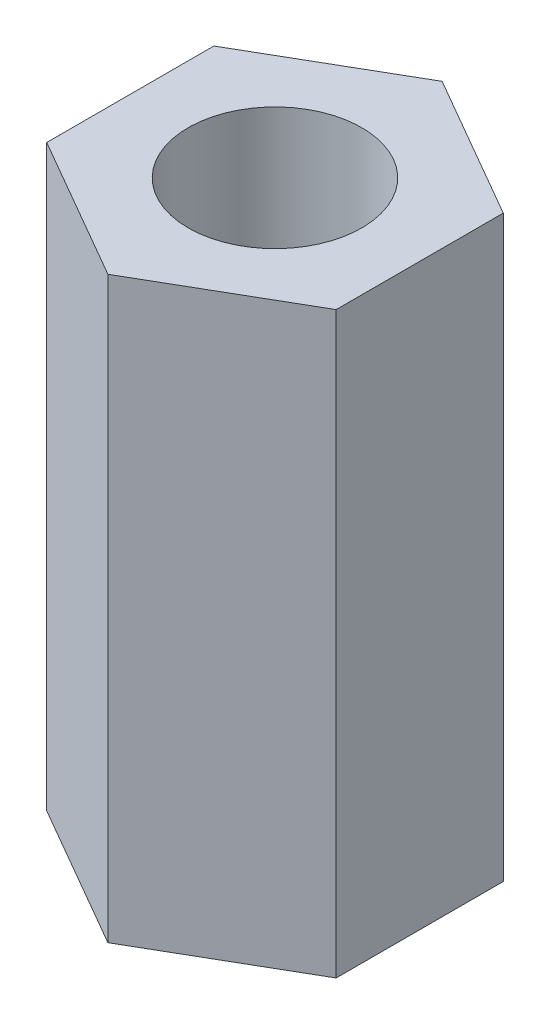
ISO-10303-21;
HEADER;
FILE_DESCRIPTION(('STEP AP214'),'2;1');
FILE_NAME('part.step','',(''),(''),'','','');
FILE_SCHEMA(('AUTOMOTIVE_DESIGN { 1 0 10303 214 1 1 1 1 }'));
ENDSEC;
DATA;
#1=APPLICATION_CONTEXT('core data for automotive mechanical design processes');
#2=APPLICATION_PROTOCOL_DEFINITION('international standard','automotive_design',2000,#1);
#3=PRODUCT_CONTEXT('',#1,'mechanical');
#4=PRODUCT('Part','Part','',(#3));
#5=PRODUCT_RELATED_PRODUCT_CATEGORY('part','',(#4));
#6=PRODUCT_DEFINITION_FORMATION('','',#4);
#7=PRODUCT_DEFINITION_CONTEXT('part definition',#1,'design');
#8=PRODUCT_DEFINITION('design','',#6,#7);
#9=PRODUCT_DEFINITION_SHAPE('','',#8);
#10=(LENGTH_UNIT() NAMED_UNIT(*) SI_UNIT(.MILLI.,.METRE.));
#11=(NAMED_UNIT(*) PLANE_ANGLE_UNIT() SI_UNIT($,.RADIAN.));
#12=(NAMED_UNIT(*) SI_UNIT($,.STERADIAN.) SOLID_ANGLE_UNIT());
#13=UNCERTAINTY_MEASURE_WITH_UNIT(LENGTH_MEASURE(1.E-05),#10,'distance_accuracy_value','');
#14=(GEOMETRIC_REPRESENTATION_CONTEXT(3) GLOBAL_UNCERTAINTY_ASSIGNED_CONTEXT((#13)) GLOBAL_UNIT_ASSIGNED_CONTEXT((#10,
#11,#12)) REPRESENTATION_CONTEXT('',''));
#15=CARTESIAN_POINT('',(0.,0.,0.));
#16=DIRECTION('',(0.,0.,1.));
#17=DIRECTION('',(1.,0.,0.));
#18=AXIS2_PLACEMENT_3D('',#15,#16,#17);
#19=CARTESIAN_POINT('',(0.,10.,0.));
#20=DIRECTION('',(0.,1.,0.));
#21=DIRECTION('',(0.,0.,1.));
#22=AXIS2_PLACEMENT_3D('',#19,#20,#21);
#23=PLANE('',#22);
#24=DIRECTION('',(-0.866025403784439,0.,-0.499999999999999));
#25=VECTOR('',#24,1.);
#26=CARTESIAN_POINT('',(-32.4518092061727,10.,-15.6504060337565));
#27=LINE('',#26,#25);
#28=CARTESIAN_POINT('',(-32.4518092061727,10.,-15.6504060337565));
#29=VERTEX_POINT('',#28);
#30=CARTESIAN_POINT('',(-34.9518092061727,10.,-17.0937817067306));
#31=VERTEX_POINT('',#30);
#32=EDGE_CURVE('E131',#29,#31,#27,.T.);
#33=ORIENTED_EDGE('',*,*,#32,.T.);
#34=DIRECTION('',(-0.866025403784438,0.,0.500000000000001));
#35=VECTOR('',#34,1.);
#36=CARTESIAN_POINT('',(-34.9518092061727,10.,-17.0937817067306));
#37=LINE('',#36,#35);
#38=CARTESIAN_POINT('',(-37.4518092061727,10.,-15.6504060337565));
#39=VERTEX_POINT('',#38);
#40=EDGE_CURVE('E89',#31,#39,#37,.T.);
#41=ORIENTED_EDGE('',*,*,#40,.T.);
#42=DIRECTION('',(0.,0.,1.));
#43=VECTOR('',#42,1.);
#44=CARTESIAN_POINT('',(-37.4518092061727,10.,-15.6504060337565));
#45=LINE('',#44,#43);
#46=CARTESIAN_POINT('',(-37.4518092061727,10.,-12.7636546878084));
#47=VERTEX_POINT('',#46);
#48=EDGE_CURVE('E102',#39,#47,#45,.T.);
#49=ORIENTED_EDGE('',*,*,#48,.T.);
#50=DIRECTION('',(0.866025403784439,0.,0.5));
#51=VECTOR('',#50,1.);
#52=CARTESIAN_POINT('',(-37.4518092061727,10.,-12.7636546878084));
#53=LINE('',#52,#51);
#54=CARTESIAN_POINT('',(-34.9518092061727,10.,-11.3202790148343));
#55=VERTEX_POINT('',#54);
#56=EDGE_CURVE('E96',#47,#55,#53,.T.);
#57=ORIENTED_EDGE('',*,*,#56,.T.);
#58=DIRECTION('',(0.866025403784439,0.,-0.5));
#59=VECTOR('',#58,1.);
#60=CARTESIAN_POINT('',(-34.9518092061727,10.,-11.3202790148343));
#61=LINE('',#60,#59);
#62=CARTESIAN_POINT('',(-32.4518092061727,10.,-12.7636546878084));
#63=VERTEX_POINT('',#62);
#64=EDGE_CURVE('E100',#55,#63,#61,.T.);
#65=ORIENTED_EDGE('',*,*,#64,.T.);
#66=DIRECTION('',(0.,0.,-1.));
#67=VECTOR('',#66,1.);
#68=CARTESIAN_POINT('',(-32.4518092061727,10.,-12.7636546878084));
#69=LINE('',#68,#67);
#70=EDGE_CURVE('E52',#63,#29,#69,.T.);
#71=ORIENTED_EDGE('',*,*,#70,.T.);
#72=EDGE_LOOP('',(#33,#41,#49,#57,#65,#71));
#73=FACE_BOUND('',#72,.T.);
#74=CARTESIAN_POINT('',(-34.9518092061727,10.,-14.2070303607825));
#75=DIRECTION('',(0.,1.,0.));
#76=DIRECTION('',(0.,0.,1.));
#77=AXIS2_PLACEMENT_3D('',#74,#75,#76);
#78=CIRCLE('',#77,1.5);
#79=CARTESIAN_POINT('',(-34.9518092061727,10.,-12.7070303607825));
#80=VERTEX_POINT('',#79);
#81=EDGE_CURVE('E124',#80,#80,#78,.T.);
#82=ORIENTED_EDGE('',*,*,#81,.F.);
#83=EDGE_LOOP('',(#82));
#84=FACE_BOUND('',#83,.T.);
#85=ADVANCED_FACE('F35',(#73,#84),#23,.T.);
#86=CARTESIAN_POINT('',(0.,0.,0.));
#87=DIRECTION('',(0.,1.,0.));
#88=DIRECTION('',(0.,0.,1.));
#89=AXIS2_PLACEMENT_3D('',#86,#87,#88);
#90=PLANE('',#89);
#91=DIRECTION('',(-0.866025403784439,0.,-0.499999999999999));
#92=VECTOR('',#91,1.);
#93=CARTESIAN_POINT('',(-32.4518092061727,0.,-15.6504060337565));
#94=LINE('',#93,#92);
#95=CARTESIAN_POINT('',(-32.4518092061727,0.,-15.6504060337565));
#96=VERTEX_POINT('',#95);
#97=CARTESIAN_POINT('',(-34.9518092061727,0.,-17.0937817067306));
#98=VERTEX_POINT('',#97);
#99=EDGE_CURVE('E120',#96,#98,#94,.T.);
#100=ORIENTED_EDGE('',*,*,#99,.F.);
#101=DIRECTION('',(0.,0.,-1.));
#102=VECTOR('',#101,1.);
#103=CARTESIAN_POINT('',(-32.4518092061727,0.,-12.7636546878084));
#104=LINE('',#103,#102);
#105=CARTESIAN_POINT('',(-32.4518092061727,0.,-12.7636546878084));
#106=VERTEX_POINT('',#105);
#107=EDGE_CURVE('E81',#106,#96,#104,.T.);
#108=ORIENTED_EDGE('',*,*,#107,.F.);
#109=DIRECTION('',(0.866025403784439,0.,-0.5));
#110=VECTOR('',#109,1.);
#111=CARTESIAN_POINT('',(-34.9518092061727,0.,-11.3202790148343));
#112=LINE('',#111,#110);
#113=CARTESIAN_POINT('',(-34.9518092061727,0.,-11.3202790148343));
#114=VERTEX_POINT('',#113);
#115=EDGE_CURVE('E75',#114,#106,#112,.T.);
#116=ORIENTED_EDGE('',*,*,#115,.F.);
#117=DIRECTION('',(0.866025403784439,0.,0.5));
#118=VECTOR('',#117,1.);
#119=CARTESIAN_POINT('',(-37.4518092061727,0.,-12.7636546878084));
#120=LINE('',#119,#118);
#121=CARTESIAN_POINT('',(-37.4518092061727,0.,-12.7636546878084));
#122=VERTEX_POINT('',#121);
#123=EDGE_CURVE('E110',#122,#114,#120,.T.);
#124=ORIENTED_EDGE('',*,*,#123,.F.);
#125=DIRECTION('',(0.,0.,1.));
#126=VECTOR('',#125,1.);
#127=CARTESIAN_POINT('',(-37.4518092061727,0.,-15.6504060337565));
#128=LINE('',#127,#126);
#129=CARTESIAN_POINT('',(-37.4518092061727,0.,-15.6504060337565));
#130=VERTEX_POINT('',#129);
#131=EDGE_CURVE('E126',#130,#122,#128,.T.);
#132=ORIENTED_EDGE('',*,*,#131,.F.);
#133=DIRECTION('',(-0.866025403784438,0.,0.500000000000001));
#134=VECTOR('',#133,1.);
#135=CARTESIAN_POINT('',(-34.9518092061727,0.,-17.0937817067306));
#136=LINE('',#135,#134);
#137=EDGE_CURVE('E123',#98,#130,#136,.T.);
#138=ORIENTED_EDGE('',*,*,#137,.F.);
#139=EDGE_LOOP('',(#100,#108,#116,#124,#132,#138));
#140=FACE_BOUND('',#139,.T.);
#141=CARTESIAN_POINT('',(-34.9518092061727,0.,-14.2070303607825));
#142=DIRECTION('',(0.,1.,0.));
#143=DIRECTION('',(0.,0.,1.));
#144=AXIS2_PLACEMENT_3D('',#141,#142,#143);
#145=CIRCLE('',#144,1.5);
#146=CARTESIAN_POINT('',(-34.9518092061727,0.,-12.7070303607825));
#147=VERTEX_POINT('',#146);
#148=EDGE_CURVE('E224',#147,#147,#145,.T.);
#149=ORIENTED_EDGE('',*,*,#148,.T.);
#150=EDGE_LOOP('',(#149));
#151=FACE_BOUND('',#150,.T.);
#152=ADVANCED_FACE('F140',(#140,#151),#90,.F.);
#153=CARTESIAN_POINT('',(-32.4518092061727,10.,-15.6504060337565));
#154=DIRECTION('',(-0.499999999999999,0.,0.866025403784439));
#155=DIRECTION('',(0.866025403784439,0.,0.499999999999999));
#156=AXIS2_PLACEMENT_3D('',#153,#154,#155);
#157=PLANE('',#156);
#158=ORIENTED_EDGE('',*,*,#99,.T.);
#159=DIRECTION('',(0.,-1.,0.));
#160=VECTOR('',#159,1.);
#161=CARTESIAN_POINT('',(-34.9518092061727,10.,-17.0937817067306));
#162=LINE('',#161,#160);
#163=EDGE_CURVE('E11',#31,#98,#162,.T.);
#164=ORIENTED_EDGE('',*,*,#163,.F.);
#165=ORIENTED_EDGE('',*,*,#32,.F.);
#166=DIRECTION('',(0.,-1.,0.));
#167=VECTOR('',#166,1.);
#168=CARTESIAN_POINT('',(-32.4518092061727,10.,-15.6504060337565));
#169=LINE('',#168,#167);
#170=EDGE_CURVE('E116',#29,#96,#169,.T.);
#171=ORIENTED_EDGE('',*,*,#170,.T.);
#172=EDGE_LOOP('',(#158,#164,#165,#171));
#173=FACE_BOUND('',#172,.T.);
#174=ADVANCED_FACE('F37',(#173),#157,.F.);
#175=CARTESIAN_POINT('',(-34.9518092061727,10.,-17.0937817067306));
#176=DIRECTION('',(0.500000000000001,0.,0.866025403784438));
#177=DIRECTION('',(0.866025403784438,0.,-0.500000000000001));
#178=AXIS2_PLACEMENT_3D('',#175,#176,#177);
#179=PLANE('',#178);
#180=ORIENTED_EDGE('',*,*,#137,.T.);
#181=DIRECTION('',(0.,-1.,0.));
#182=VECTOR('',#181,1.);
#183=CARTESIAN_POINT('',(-37.4518092061727,10.,-15.6504060337565));
#184=LINE('',#183,#182);
#185=EDGE_CURVE('E44',#39,#130,#184,.T.);
#186=ORIENTED_EDGE('',*,*,#185,.F.);
#187=ORIENTED_EDGE('',*,*,#40,.F.);
#188=ORIENTED_EDGE('',*,*,#163,.T.);
#189=EDGE_LOOP('',(#180,#186,#187,#188));
#190=FACE_BOUND('',#189,.T.);
#191=ADVANCED_FACE('F165',(#190),#179,.F.);
#192=CARTESIAN_POINT('',(-37.4518092061727,10.,-15.6504060337565));
#193=DIRECTION('',(1.,0.,0.));
#194=DIRECTION('',(0.,0.,-1.));
#195=AXIS2_PLACEMENT_3D('',#192,#193,#194);
#196=PLANE('',#195);
#197=ORIENTED_EDGE('',*,*,#131,.T.);
#198=DIRECTION('',(0.,-1.,0.));
#199=VECTOR('',#198,1.);
#200=CARTESIAN_POINT('',(-37.4518092061727,10.,-12.7636546878084));
#201=LINE('',#200,#199);
#202=EDGE_CURVE('E111',#47,#122,#201,.T.);
#203=ORIENTED_EDGE('',*,*,#202,.F.);
#204=ORIENTED_EDGE('',*,*,#48,.F.);
#205=ORIENTED_EDGE('',*,*,#185,.T.);
#206=EDGE_LOOP('',(#197,#203,#204,#205));
#207=FACE_BOUND('',#206,.T.);
#208=ADVANCED_FACE('F137',(#207),#196,.F.);
#209=CARTESIAN_POINT('',(-37.4518092061727,10.,-12.7636546878084));
#210=DIRECTION('',(0.5,0.,-0.866025403784439));
#211=DIRECTION('',(-0.866025403784439,0.,-0.5));
#212=AXIS2_PLACEMENT_3D('',#209,#210,#211);
#213=PLANE('',#212);
#214=ORIENTED_EDGE('',*,*,#123,.T.);
#215=DIRECTION('',(0.,-1.,0.));
#216=VECTOR('',#215,1.);
#217=CARTESIAN_POINT('',(-34.9518092061727,10.,-11.3202790148343));
#218=LINE('',#217,#216);
#219=EDGE_CURVE('E107',#55,#114,#218,.T.);
#220=ORIENTED_EDGE('',*,*,#219,.F.);
#221=ORIENTED_EDGE('',*,*,#56,.F.);
#222=ORIENTED_EDGE('',*,*,#202,.T.);
#223=EDGE_LOOP('',(#214,#220,#221,#222));
#224=FACE_BOUND('',#223,.T.);
#225=ADVANCED_FACE('F108',(#224),#213,.F.);
#226=CARTESIAN_POINT('',(-34.9518092061727,10.,-11.3202790148343));
#227=DIRECTION('',(-0.5,0.,-0.866025403784439));
#228=DIRECTION('',(-0.866025403784439,0.,0.5));
#229=AXIS2_PLACEMENT_3D('',#226,#227,#228);
#230=PLANE('',#229);
#231=ORIENTED_EDGE('',*,*,#115,.T.);
#232=DIRECTION('',(0.,-1.,0.));
#233=VECTOR('',#232,1.);
#234=CARTESIAN_POINT('',(-32.4518092061727,10.,-12.7636546878084));
#235=LINE('',#234,#233);
#236=EDGE_CURVE('E112',#63,#106,#235,.T.);
#237=ORIENTED_EDGE('',*,*,#236,.F.);
#238=ORIENTED_EDGE('',*,*,#64,.F.);
#239=ORIENTED_EDGE('',*,*,#219,.T.);
#240=EDGE_LOOP('',(#231,#237,#238,#239));
#241=FACE_BOUND('',#240,.T.);
#242=ADVANCED_FACE('F114',(#241),#230,.F.);
#243=CARTESIAN_POINT('',(-32.4518092061727,10.,-12.7636546878084));
#244=DIRECTION('',(-1.,0.,0.));
#245=DIRECTION('',(0.,0.,1.));
#246=AXIS2_PLACEMENT_3D('',#243,#244,#245);
#247=PLANE('',#246);
#248=ORIENTED_EDGE('',*,*,#107,.T.);
#249=ORIENTED_EDGE('',*,*,#170,.F.);
#250=ORIENTED_EDGE('',*,*,#70,.F.);
#251=ORIENTED_EDGE('',*,*,#236,.T.);
#252=EDGE_LOOP('',(#248,#249,#250,#251));
#253=FACE_BOUND('',#252,.T.);
#254=ADVANCED_FACE('F145',(#253),#247,.F.);
#255=CARTESIAN_POINT('',(-34.9518092061727,10.,-14.2070303607825));
#256=DIRECTION('',(0.,-1.,0.));
#257=DIRECTION('',(0.,0.,-1.));
#258=AXIS2_PLACEMENT_3D('',#255,#256,#257);
#259=CYLINDRICAL_SURFACE('',#258,1.5);
#260=ORIENTED_EDGE('',*,*,#81,.T.);
#261=EDGE_LOOP('',(#260));
#262=FACE_BOUND('',#261,.T.);
#263=ORIENTED_EDGE('',*,*,#148,.F.);
#264=EDGE_LOOP('',(#263));
#265=FACE_BOUND('',#264,.T.);
#266=ADVANCED_FACE('F147',(#262,#265),#259,.F.);
#267=CLOSED_SHELL('',(#85,#152,#174,#191,#208,#225,#242,#254,#266));
#268=MANIFOLD_SOLID_BREP('B2',#267);
#269=ADVANCED_BREP_SHAPE_REPRESENTATION('',(#18,#268),#14);
#270=SHAPE_DEFINITION_REPRESENTATION(#9,#269);
ENDSEC;
END-ISO-10303-21;
